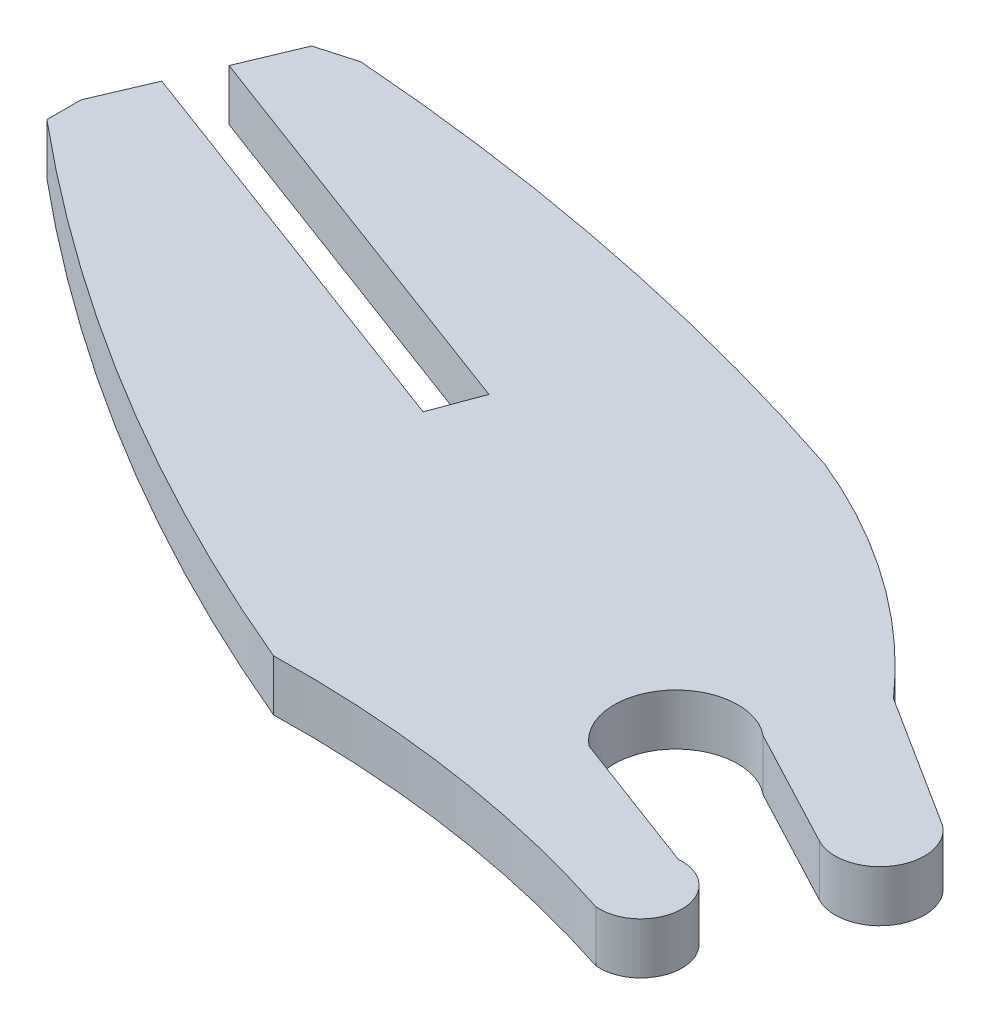
ISO-10303-21;
HEADER;
FILE_DESCRIPTION(('STEP AP214'),'2;1');
FILE_NAME('part.step','',(''),(''),'','','');
FILE_SCHEMA(('AUTOMOTIVE_DESIGN { 1 0 10303 214 1 1 1 1 }'));
ENDSEC;
DATA;
#1=APPLICATION_CONTEXT('core data for automotive mechanical design processes');
#2=APPLICATION_PROTOCOL_DEFINITION('international standard','automotive_design',2000,#1);
#3=PRODUCT_CONTEXT('',#1,'mechanical');
#4=PRODUCT('Part','Part','',(#3));
#5=PRODUCT_RELATED_PRODUCT_CATEGORY('part','',(#4));
#6=PRODUCT_DEFINITION_FORMATION('','',#4);
#7=PRODUCT_DEFINITION_CONTEXT('part definition',#1,'design');
#8=PRODUCT_DEFINITION('design','',#6,#7);
#9=PRODUCT_DEFINITION_SHAPE('','',#8);
#10=(LENGTH_UNIT() NAMED_UNIT(*) SI_UNIT(.MILLI.,.METRE.));
#11=(NAMED_UNIT(*) PLANE_ANGLE_UNIT() SI_UNIT($,.RADIAN.));
#12=(NAMED_UNIT(*) SI_UNIT($,.STERADIAN.) SOLID_ANGLE_UNIT());
#13=UNCERTAINTY_MEASURE_WITH_UNIT(LENGTH_MEASURE(1.E-05),#10,'distance_accuracy_value','');
#14=(GEOMETRIC_REPRESENTATION_CONTEXT(3) GLOBAL_UNCERTAINTY_ASSIGNED_CONTEXT((#13)) GLOBAL_UNIT_ASSIGNED_CONTEXT((#10,
#11,#12)) REPRESENTATION_CONTEXT('',''));
#15=CARTESIAN_POINT('',(0.,0.,0.));
#16=DIRECTION('',(0.,0.,1.));
#17=DIRECTION('',(1.,0.,0.));
#18=AXIS2_PLACEMENT_3D('',#15,#16,#17);
#19=CARTESIAN_POINT('',(-181.665374204054,2.,-473.760145882055));
#20=DIRECTION('',(0.,-1.,0.));
#21=DIRECTION('',(0.,0.,-1.));
#22=AXIS2_PLACEMENT_3D('',#19,#20,#21);
#23=CYLINDRICAL_SURFACE('',#22,24.9948568131);
#24=CARTESIAN_POINT('',(-181.665374204054,0.,-473.760145882055));
#25=DIRECTION('',(0.,1.,0.));
#26=DIRECTION('',(0.,0.,1.));
#27=AXIS2_PLACEMENT_3D('',#24,#25,#26);
#28=CIRCLE('',#27,24.9948568131);
#29=CARTESIAN_POINT('',(-162.931799999989,0.,-490.306930000069));
#30=VERTEX_POINT('',#29);
#31=CARTESIAN_POINT('',(-172.204679999949,0.,-496.895360000013));
#32=VERTEX_POINT('',#31);
#33=EDGE_CURVE('E11',#30,#32,#28,.T.);
#34=ORIENTED_EDGE('',*,*,#33,.T.);
#35=DIRECTION('',(0.,-1.,0.));
#36=VECTOR('',#35,1.);
#37=CARTESIAN_POINT('',(-172.204679999949,2.,-496.895360000013));
#38=LINE('',#37,#36);
#39=CARTESIAN_POINT('',(-172.204679999949,2.,-496.895360000013));
#40=VERTEX_POINT('',#39);
#41=EDGE_CURVE('E343',#40,#32,#38,.T.);
#42=ORIENTED_EDGE('',*,*,#41,.F.);
#43=CARTESIAN_POINT('',(-181.665374204054,2.,-473.760145882055));
#44=DIRECTION('',(0.,1.,0.));
#45=DIRECTION('',(0.,0.,1.));
#46=AXIS2_PLACEMENT_3D('',#43,#44,#45);
#47=CIRCLE('',#46,24.9948568131);
#48=CARTESIAN_POINT('',(-162.931799999989,2.,-490.306930000069));
#49=VERTEX_POINT('',#48);
#50=EDGE_CURVE('E41',#49,#40,#47,.T.);
#51=ORIENTED_EDGE('',*,*,#50,.F.);
#52=DIRECTION('',(0.,-1.,0.));
#53=VECTOR('',#52,1.);
#54=CARTESIAN_POINT('',(-162.931799999989,2.,-490.306930000069));
#55=LINE('',#54,#53);
#56=EDGE_CURVE('E195',#49,#30,#55,.T.);
#57=ORIENTED_EDGE('',*,*,#56,.T.);
#58=EDGE_LOOP('',(#34,#42,#51,#57));
#59=FACE_BOUND('',#58,.T.);
#60=ADVANCED_FACE('F37',(#59),#23,.T.);
#61=CARTESIAN_POINT('',(-201.880906041195,2.,-407.843339205055));
#62=DIRECTION('',(0.,-1.,0.));
#63=DIRECTION('',(0.,0.,-1.));
#64=AXIS2_PLACEMENT_3D('',#61,#62,#63);
#65=CYLINDRICAL_SURFACE('',#64,93.8666117409);
#66=CARTESIAN_POINT('',(-201.880906041195,0.,-407.843339205055));
#67=DIRECTION('',(0.,1.,0.));
#68=DIRECTION('',(0.,0.,1.));
#69=AXIS2_PLACEMENT_3D('',#66,#67,#68);
#70=CIRCLE('',#69,93.8666117409);
#71=CARTESIAN_POINT('',(-194.876650000056,0.,-501.448259999995));
#72=VERTEX_POINT('',#71);
#73=EDGE_CURVE('E47',#32,#72,#70,.T.);
#74=ORIENTED_EDGE('',*,*,#73,.T.);
#75=DIRECTION('',(0.,-1.,0.));
#76=VECTOR('',#75,1.);
#77=CARTESIAN_POINT('',(-194.876650000056,2.,-501.448259999995));
#78=LINE('',#77,#76);
#79=CARTESIAN_POINT('',(-194.876650000056,2.,-501.448259999995));
#80=VERTEX_POINT('',#79);
#81=EDGE_CURVE('E171',#80,#72,#78,.T.);
#82=ORIENTED_EDGE('',*,*,#81,.F.);
#83=CARTESIAN_POINT('',(-201.880906041195,2.,-407.843339205055));
#84=DIRECTION('',(0.,1.,0.));
#85=DIRECTION('',(0.,0.,1.));
#86=AXIS2_PLACEMENT_3D('',#83,#84,#85);
#87=CIRCLE('',#86,93.8666117409);
#88=EDGE_CURVE('E110',#40,#80,#87,.T.);
#89=ORIENTED_EDGE('',*,*,#88,.F.);
#90=ORIENTED_EDGE('',*,*,#41,.T.);
#91=EDGE_LOOP('',(#74,#82,#89,#90));
#92=FACE_BOUND('',#91,.T.);
#93=ADVANCED_FACE('F344',(#92),#65,.T.);
#94=CARTESIAN_POINT('',(-482.243113178539,2.,-419.381304528257));
#95=DIRECTION('',(0.274604349057139,0.,0.961557305353615));
#96=DIRECTION('',(0.961557305353615,0.,-0.274604349057139));
#97=AXIS2_PLACEMENT_3D('',#94,#95,#96);
#98=PLANE('',#97);
#99=DIRECTION('',(-0.961557305353615,0.,0.274604349057139));
#100=VECTOR('',#99,1.);
#101=CARTESIAN_POINT('',(-482.243113178539,0.,-419.381304528257));
#102=LINE('',#101,#100);
#103=CARTESIAN_POINT('',(-196.377439999989,0.,-501.019660000069));
#104=VERTEX_POINT('',#103);
#105=EDGE_CURVE('E165',#72,#104,#102,.T.);
#106=ORIENTED_EDGE('',*,*,#105,.T.);
#107=DIRECTION('',(0.,-1.,0.));
#108=VECTOR('',#107,1.);
#109=CARTESIAN_POINT('',(-196.377439999989,2.,-501.019660000069));
#110=LINE('',#109,#108);
#111=CARTESIAN_POINT('',(-196.377439999989,2.,-501.019660000069));
#112=VERTEX_POINT('',#111);
#113=EDGE_CURVE('E169',#112,#104,#110,.T.);
#114=ORIENTED_EDGE('',*,*,#113,.F.);
#115=DIRECTION('',(-0.961557305353615,0.,0.274604349057139));
#116=VECTOR('',#115,1.);
#117=CARTESIAN_POINT('',(-482.243113178539,2.,-419.381304528257));
#118=LINE('',#117,#116);
#119=EDGE_CURVE('E222',#80,#112,#118,.T.);
#120=ORIENTED_EDGE('',*,*,#119,.F.);
#121=ORIENTED_EDGE('',*,*,#81,.T.);
#122=EDGE_LOOP('',(#106,#114,#120,#121));
#123=FACE_BOUND('',#122,.T.);
#124=ADVANCED_FACE('F167',(#123),#98,.F.);
#125=CARTESIAN_POINT('',(-220.079780414751,2.,-444.318236236712));
#126=DIRECTION('',(0.922632944196995,0.,0.385679206442847));
#127=DIRECTION('',(0.385679206442847,0.,-0.922632944196995));
#128=AXIS2_PLACEMENT_3D('',#125,#126,#127);
#129=PLANE('',#128);
#130=DIRECTION('',(-0.385679206442847,0.,0.922632944196995));
#131=VECTOR('',#130,1.);
#132=CARTESIAN_POINT('',(-220.079780414751,0.,-444.318236236712));
#133=LINE('',#132,#131);
#134=CARTESIAN_POINT('',(-197.327369999989,0.,-498.747210000069));
#135=VERTEX_POINT('',#134);
#136=EDGE_CURVE('E173',#104,#135,#133,.T.);
#137=ORIENTED_EDGE('',*,*,#136,.T.);
#138=DIRECTION('',(0.,-1.,0.));
#139=VECTOR('',#138,1.);
#140=CARTESIAN_POINT('',(-197.327369999989,2.,-498.747210000069));
#141=LINE('',#140,#139);
#142=CARTESIAN_POINT('',(-197.327369999989,2.,-498.747210000069));
#143=VERTEX_POINT('',#142);
#144=EDGE_CURVE('E180',#143,#135,#141,.T.);
#145=ORIENTED_EDGE('',*,*,#144,.F.);
#146=DIRECTION('',(-0.385679206442847,0.,0.922632944196995));
#147=VECTOR('',#146,1.);
#148=CARTESIAN_POINT('',(-220.079780414751,2.,-444.318236236712));
#149=LINE('',#148,#147);
#150=EDGE_CURVE('E179',#112,#143,#149,.T.);
#151=ORIENTED_EDGE('',*,*,#150,.F.);
#152=ORIENTED_EDGE('',*,*,#113,.T.);
#153=EDGE_LOOP('',(#137,#145,#151,#152));
#154=FACE_BOUND('',#153,.T.);
#155=ADVANCED_FACE('F176',(#154),#129,.F.);
#156=CARTESIAN_POINT('',(-509.719619442517,2.,-615.395607149388));
#157=DIRECTION('',(0.349811956896214,0.,-0.936819937241112));
#158=DIRECTION('',(-0.936819937241112,0.,-0.349811956896214));
#159=AXIS2_PLACEMENT_3D('',#156,#157,#158);
#160=PLANE('',#159);
#161=DIRECTION('',(0.936819937241112,0.,0.349811956896214));
#162=VECTOR('',#161,1.);
#163=CARTESIAN_POINT('',(-509.719619442517,0.,-615.395607149388));
#164=LINE('',#163,#162);
#165=CARTESIAN_POINT('',(-181.123509999976,0.,-492.696630000064));
#166=VERTEX_POINT('',#165);
#167=EDGE_CURVE('E185',#135,#166,#164,.T.);
#168=ORIENTED_EDGE('',*,*,#167,.T.);
#169=DIRECTION('',(0.,-1.,0.));
#170=VECTOR('',#169,1.);
#171=CARTESIAN_POINT('',(-181.123509999976,2.,-492.696630000064));
#172=LINE('',#171,#170);
#173=CARTESIAN_POINT('',(-181.123509999976,2.,-492.696630000064));
#174=VERTEX_POINT('',#173);
#175=EDGE_CURVE('E261',#174,#166,#172,.T.);
#176=ORIENTED_EDGE('',*,*,#175,.F.);
#177=DIRECTION('',(0.936819937241112,0.,0.349811956896214));
#178=VECTOR('',#177,1.);
#179=CARTESIAN_POINT('',(-509.719619442517,2.,-615.395607149388));
#180=LINE('',#179,#178);
#181=EDGE_CURVE('E219',#143,#174,#180,.T.);
#182=ORIENTED_EDGE('',*,*,#181,.F.);
#183=ORIENTED_EDGE('',*,*,#144,.T.);
#184=EDGE_LOOP('',(#168,#176,#182,#183));
#185=FACE_BOUND('',#184,.T.);
#186=ADVANCED_FACE('F338',(#185),#160,.F.);
#187=CARTESIAN_POINT('',(-197.2732848146,2.,-449.446202505606));
#188=DIRECTION('',(0.936820586215669,0.,0.349810218893804));
#189=DIRECTION('',(0.349810218893804,0.,-0.936820586215669));
#190=AXIS2_PLACEMENT_3D('',#187,#188,#189);
#191=PLANE('',#190);
#192=DIRECTION('',(-0.349810218893804,0.,0.936820586215669));
#193=VECTOR('',#192,1.);
#194=CARTESIAN_POINT('',(-197.2732848146,0.,-449.446202505606));
#195=LINE('',#194,#193);
#196=CARTESIAN_POINT('',(-181.82313,0.,-490.82299));
#197=VERTEX_POINT('',#196);
#198=EDGE_CURVE('E187',#166,#197,#195,.T.);
#199=ORIENTED_EDGE('',*,*,#198,.T.);
#200=DIRECTION('',(0.,-1.,0.));
#201=VECTOR('',#200,1.);
#202=CARTESIAN_POINT('',(-181.82313,2.,-490.82299));
#203=LINE('',#202,#201);
#204=CARTESIAN_POINT('',(-181.82313,2.,-490.82299));
#205=VERTEX_POINT('',#204);
#206=EDGE_CURVE('E258',#205,#197,#203,.T.);
#207=ORIENTED_EDGE('',*,*,#206,.F.);
#208=DIRECTION('',(-0.349810218893804,0.,0.936820586215669));
#209=VECTOR('',#208,1.);
#210=CARTESIAN_POINT('',(-197.2732848146,2.,-449.446202505606));
#211=LINE('',#210,#209);
#212=EDGE_CURVE('E217',#174,#205,#211,.T.);
#213=ORIENTED_EDGE('',*,*,#212,.F.);
#214=ORIENTED_EDGE('',*,*,#175,.T.);
#215=EDGE_LOOP('',(#199,#207,#213,#214));
#216=FACE_BOUND('',#215,.T.);
#217=ADVANCED_FACE('F256',(#216),#191,.F.);
#218=CARTESIAN_POINT('',(-510.419222862414,2.,-613.522006725113));
#219=DIRECTION('',(-0.349812071409836,0.,0.936819894481303));
#220=DIRECTION('',(0.936819894481303,0.,0.349812071409836));
#221=AXIS2_PLACEMENT_3D('',#218,#219,#220);
#222=PLANE('',#221);
#223=DIRECTION('',(-0.936819894481303,0.,-0.349812071409836));
#224=VECTOR('',#223,1.);
#225=CARTESIAN_POINT('',(-510.419222862414,0.,-613.522006725113));
#226=LINE('',#225,#224);
#227=CARTESIAN_POINT('',(-198.11611,0.,-496.90685));
#228=VERTEX_POINT('',#227);
#229=EDGE_CURVE('E251',#197,#228,#226,.T.);
#230=ORIENTED_EDGE('',*,*,#229,.T.);
#231=DIRECTION('',(0.,-1.,0.));
#232=VECTOR('',#231,1.);
#233=CARTESIAN_POINT('',(-198.11611,2.,-496.90685));
#234=LINE('',#233,#232);
#235=CARTESIAN_POINT('',(-198.11611,2.,-496.90685));
#236=VERTEX_POINT('',#235);
#237=EDGE_CURVE('E267',#236,#228,#234,.T.);
#238=ORIENTED_EDGE('',*,*,#237,.F.);
#239=DIRECTION('',(-0.936819894481303,0.,-0.349812071409836));
#240=VECTOR('',#239,1.);
#241=CARTESIAN_POINT('',(-510.419222862414,2.,-613.522006725113));
#242=LINE('',#241,#240);
#243=EDGE_CURVE('E215',#205,#236,#242,.T.);
#244=ORIENTED_EDGE('',*,*,#243,.F.);
#245=ORIENTED_EDGE('',*,*,#206,.T.);
#246=EDGE_LOOP('',(#230,#238,#244,#245));
#247=FACE_BOUND('',#246,.T.);
#248=ADVANCED_FACE('F264',(#247),#222,.F.);
#249=CARTESIAN_POINT('',(-221.369592411402,2.,-442.352693684703));
#250=DIRECTION('',(0.919917844036022,0.,0.39211115799492));
#251=DIRECTION('',(0.39211115799492,0.,-0.919917844036022));
#252=AXIS2_PLACEMENT_3D('',#249,#250,#251);
#253=PLANE('',#252);
#254=DIRECTION('',(-0.39211115799492,0.,0.919917844036022));
#255=VECTOR('',#254,1.);
#256=CARTESIAN_POINT('',(-221.369592411402,0.,-442.352693684703));
#257=LINE('',#256,#255);
#258=CARTESIAN_POINT('',(-199.05715,0.,-494.69911));
#259=VERTEX_POINT('',#258);
#260=EDGE_CURVE('E249',#228,#259,#257,.T.);
#261=ORIENTED_EDGE('',*,*,#260,.T.);
#262=DIRECTION('',(0.,-1.,0.));
#263=VECTOR('',#262,1.);
#264=CARTESIAN_POINT('',(-199.05715,2.,-494.69911));
#265=LINE('',#264,#263);
#266=CARTESIAN_POINT('',(-199.05715,2.,-494.69911));
#267=VERTEX_POINT('',#266);
#268=EDGE_CURVE('E277',#267,#259,#265,.T.);
#269=ORIENTED_EDGE('',*,*,#268,.F.);
#270=DIRECTION('',(-0.39211115799492,0.,0.919917844036022));
#271=VECTOR('',#270,1.);
#272=CARTESIAN_POINT('',(-221.369592411402,2.,-442.352693684703));
#273=LINE('',#272,#271);
#274=EDGE_CURVE('E213',#236,#267,#273,.T.);
#275=ORIENTED_EDGE('',*,*,#274,.F.);
#276=ORIENTED_EDGE('',*,*,#237,.T.);
#277=EDGE_LOOP('',(#261,#269,#275,#276));
#278=FACE_BOUND('',#277,.T.);
#279=ADVANCED_FACE('F275',(#278),#253,.F.);
#280=CARTESIAN_POINT('',(-199.05715,2.,-572.1446));
#281=DIRECTION('',(1.,0.,0.));
#282=DIRECTION('',(0.,0.,-1.));
#283=AXIS2_PLACEMENT_3D('',#280,#281,#282);
#284=PLANE('',#283);
#285=DIRECTION('',(0.,0.,1.));
#286=VECTOR('',#285,1.);
#287=CARTESIAN_POINT('',(-199.05715,0.,-572.1446));
#288=LINE('',#287,#286);
#289=CARTESIAN_POINT('',(-199.05715,0.,-493.36006));
#290=VERTEX_POINT('',#289);
#291=EDGE_CURVE('E247',#259,#290,#288,.T.);
#292=ORIENTED_EDGE('',*,*,#291,.T.);
#293=DIRECTION('',(0.,-1.,0.));
#294=VECTOR('',#293,1.);
#295=CARTESIAN_POINT('',(-199.05715,2.,-493.36006));
#296=LINE('',#295,#294);
#297=CARTESIAN_POINT('',(-199.05715,2.,-493.36006));
#298=VERTEX_POINT('',#297);
#299=EDGE_CURVE('E283',#298,#290,#296,.T.);
#300=ORIENTED_EDGE('',*,*,#299,.F.);
#301=DIRECTION('',(0.,0.,1.));
#302=VECTOR('',#301,1.);
#303=CARTESIAN_POINT('',(-199.05715,2.,-572.1446));
#304=LINE('',#303,#302);
#305=EDGE_CURVE('E211',#267,#298,#304,.T.);
#306=ORIENTED_EDGE('',*,*,#305,.F.);
#307=ORIENTED_EDGE('',*,*,#268,.T.);
#308=EDGE_LOOP('',(#292,#300,#306,#307));
#309=FACE_BOUND('',#308,.T.);
#310=ADVANCED_FACE('F280',(#309),#284,.F.);
#311=CARTESIAN_POINT('',(-141.953553513997,2.,-561.908172135341));
#312=DIRECTION('',(0.,-1.,0.));
#313=DIRECTION('',(0.,0.,-1.));
#314=AXIS2_PLACEMENT_3D('',#311,#312,#313);
#315=CYLINDRICAL_SURFACE('',#314,89.2169513543001);
#316=CARTESIAN_POINT('',(-141.953553513997,0.,-561.908172135341));
#317=DIRECTION('',(0.,1.,0.));
#318=DIRECTION('',(0.,0.,1.));
#319=AXIS2_PLACEMENT_3D('',#316,#317,#318);
#320=CIRCLE('',#319,89.2169513543001);
#321=CARTESIAN_POINT('',(-176.492660000002,0.,-479.648130000025));
#322=VERTEX_POINT('',#321);
#323=EDGE_CURVE('E244',#290,#322,#320,.T.);
#324=ORIENTED_EDGE('',*,*,#323,.T.);
#325=DIRECTION('',(0.,-1.,0.));
#326=VECTOR('',#325,1.);
#327=CARTESIAN_POINT('',(-176.492660000002,2.,-479.648130000025));
#328=LINE('',#327,#326);
#329=CARTESIAN_POINT('',(-176.492660000002,2.,-479.648130000025));
#330=VERTEX_POINT('',#329);
#331=EDGE_CURVE('E285',#330,#322,#328,.T.);
#332=ORIENTED_EDGE('',*,*,#331,.F.);
#333=CARTESIAN_POINT('',(-141.953553513997,2.,-561.908172135341));
#334=DIRECTION('',(0.,1.,0.));
#335=DIRECTION('',(0.,0.,1.));
#336=AXIS2_PLACEMENT_3D('',#333,#334,#335);
#337=CIRCLE('',#336,89.2169513543001);
#338=EDGE_CURVE('E209',#298,#330,#337,.T.);
#339=ORIENTED_EDGE('',*,*,#338,.F.);
#340=ORIENTED_EDGE('',*,*,#299,.T.);
#341=EDGE_LOOP('',(#324,#332,#339,#340));
#342=FACE_BOUND('',#341,.T.);
#343=ADVANCED_FACE('F334',(#342),#315,.T.);
#344=CARTESIAN_POINT('',(-175.536136222701,2.,-435.170060923836));
#345=DIRECTION('',(0.,-1.,0.));
#346=DIRECTION('',(0.,0.,-1.));
#347=AXIS2_PLACEMENT_3D('',#344,#345,#346);
#348=CYLINDRICAL_SURFACE('',#347,44.4883531554358);
#349=CARTESIAN_POINT('',(-175.536136222701,0.,-435.170060923836));
#350=DIRECTION('',(0.,1.,0.));
#351=DIRECTION('',(0.,0.,1.));
#352=AXIS2_PLACEMENT_3D('',#349,#350,#351);
#353=CIRCLE('',#352,44.4883531554358);
#354=CARTESIAN_POINT('',(-161.699150000021,0.,-477.451870000035));
#355=VERTEX_POINT('',#354);
#356=EDGE_CURVE('E241',#355,#322,#353,.T.);
#357=ORIENTED_EDGE('',*,*,#356,.F.);
#358=DIRECTION('',(0.,-1.,0.));
#359=VECTOR('',#358,1.);
#360=CARTESIAN_POINT('',(-161.699150000021,2.,-477.451870000035));
#361=LINE('',#360,#359);
#362=CARTESIAN_POINT('',(-161.699150000021,2.,-477.451870000035));
#363=VERTEX_POINT('',#362);
#364=EDGE_CURVE('E290',#363,#355,#361,.T.);
#365=ORIENTED_EDGE('',*,*,#364,.F.);
#366=CARTESIAN_POINT('',(-175.536136222701,2.,-435.170060923836));
#367=DIRECTION('',(0.,1.,0.));
#368=DIRECTION('',(0.,0.,1.));
#369=AXIS2_PLACEMENT_3D('',#366,#367,#368);
#370=CIRCLE('',#369,44.4883531554358);
#371=EDGE_CURVE('E206',#363,#330,#370,.T.);
#372=ORIENTED_EDGE('',*,*,#371,.T.);
#373=ORIENTED_EDGE('',*,*,#331,.T.);
#374=EDGE_LOOP('',(#357,#365,#372,#373));
#375=FACE_BOUND('',#374,.T.);
#376=ADVANCED_FACE('F331',(#375),#348,.F.);
#377=CARTESIAN_POINT('',(-161.557540000307,2.,-479.058795000042));
#378=DIRECTION('',(0.,-1.,0.));
#379=DIRECTION('',(0.,0.,-1.));
#380=AXIS2_PLACEMENT_3D('',#377,#378,#379);
#381=CYLINDRICAL_SURFACE('',#380,1.61315261140004);
#382=CARTESIAN_POINT('',(-161.557540000307,0.,-479.058795000042));
#383=DIRECTION('',(0.,1.,0.));
#384=DIRECTION('',(0.,0.,1.));
#385=AXIS2_PLACEMENT_3D('',#382,#383,#384);
#386=CIRCLE('',#385,1.61315261140004);
#387=CARTESIAN_POINT('',(-161.699149999989,0.,-480.665720000052));
#388=VERTEX_POINT('',#387);
#389=EDGE_CURVE('E239',#355,#388,#386,.T.);
#390=ORIENTED_EDGE('',*,*,#389,.T.);
#391=DIRECTION('',(0.,-1.,0.));
#392=VECTOR('',#391,1.);
#393=CARTESIAN_POINT('',(-161.699149999989,2.,-480.665720000052));
#394=LINE('',#393,#392);
#395=CARTESIAN_POINT('',(-161.699149999989,2.,-480.665720000052));
#396=VERTEX_POINT('',#395);
#397=EDGE_CURVE('E292',#396,#388,#394,.T.);
#398=ORIENTED_EDGE('',*,*,#397,.F.);
#399=CARTESIAN_POINT('',(-161.557540000307,2.,-479.058795000042));
#400=DIRECTION('',(0.,1.,0.));
#401=DIRECTION('',(0.,0.,1.));
#402=AXIS2_PLACEMENT_3D('',#399,#400,#401);
#403=CIRCLE('',#402,1.61315261140004);
#404=EDGE_CURVE('E204',#363,#396,#403,.T.);
#405=ORIENTED_EDGE('',*,*,#404,.F.);
#406=ORIENTED_EDGE('',*,*,#364,.T.);
#407=EDGE_LOOP('',(#390,#398,#405,#406));
#408=FACE_BOUND('',#407,.T.);
#409=ADVANCED_FACE('F328',(#408),#381,.T.);
#410=CARTESIAN_POINT('',(-511.081396419342,2.,-611.604149671496));
#411=DIRECTION('',(-0.350935661379806,0.,0.936399573671367));
#412=DIRECTION('',(0.936399573671367,0.,0.350935661379806));
#413=AXIS2_PLACEMENT_3D('',#410,#411,#412);
#414=PLANE('',#413);
#415=DIRECTION('',(-0.936399573671367,0.,-0.350935661379806));
#416=VECTOR('',#415,1.);
#417=CARTESIAN_POINT('',(-511.081396419342,0.,-611.604149671496));
#418=LINE('',#417,#416);
#419=CARTESIAN_POINT('',(-167.27350999999,0.,-482.75483000007));
#420=VERTEX_POINT('',#419);
#421=EDGE_CURVE('E236',#388,#420,#418,.T.);
#422=ORIENTED_EDGE('',*,*,#421,.T.);
#423=DIRECTION('',(0.,-1.,0.));
#424=VECTOR('',#423,1.);
#425=CARTESIAN_POINT('',(-167.27350999999,2.,-482.75483000007));
#426=LINE('',#425,#424);
#427=CARTESIAN_POINT('',(-167.27350999999,2.,-482.75483000007));
#428=VERTEX_POINT('',#427);
#429=EDGE_CURVE('E295',#428,#420,#426,.T.);
#430=ORIENTED_EDGE('',*,*,#429,.F.);
#431=DIRECTION('',(-0.936399573671367,0.,-0.350935661379806));
#432=VECTOR('',#431,1.);
#433=CARTESIAN_POINT('',(-511.081396419342,2.,-611.604149671496));
#434=LINE('',#433,#432);
#435=EDGE_CURVE('E202',#396,#428,#434,.T.);
#436=ORIENTED_EDGE('',*,*,#435,.F.);
#437=ORIENTED_EDGE('',*,*,#397,.T.);
#438=EDGE_LOOP('',(#422,#430,#436,#437));
#439=FACE_BOUND('',#438,.T.);
#440=ADVANCED_FACE('F323',(#439),#414,.F.);
#441=CARTESIAN_POINT('',(-165.76308155372,2.,-484.643498093432));
#442=DIRECTION('',(0.,-1.,0.));
#443=DIRECTION('',(0.,0.,-1.));
#444=AXIS2_PLACEMENT_3D('',#441,#442,#443);
#445=CYLINDRICAL_SURFACE('',#444,2.4183592078484);
#446=CARTESIAN_POINT('',(-165.76308155372,0.,-484.643498093432));
#447=DIRECTION('',(0.,1.,0.));
#448=DIRECTION('',(0.,0.,1.));
#449=AXIS2_PLACEMENT_3D('',#446,#447,#448);
#450=CIRCLE('',#449,2.4183592078484);
#451=CARTESIAN_POINT('',(-164.218199999973,0.,-486.504090000079));
#452=VERTEX_POINT('',#451);
#453=EDGE_CURVE('E233',#452,#420,#450,.T.);
#454=ORIENTED_EDGE('',*,*,#453,.F.);
#455=DIRECTION('',(0.,-1.,0.));
#456=VECTOR('',#455,1.);
#457=CARTESIAN_POINT('',(-164.218199999973,2.,-486.504090000079));
#458=LINE('',#457,#456);
#459=CARTESIAN_POINT('',(-164.218199999973,2.,-486.504090000079));
#460=VERTEX_POINT('',#459);
#461=EDGE_CURVE('E297',#460,#452,#458,.T.);
#462=ORIENTED_EDGE('',*,*,#461,.F.);
#463=CARTESIAN_POINT('',(-165.76308155372,2.,-484.643498093432));
#464=DIRECTION('',(0.,1.,0.));
#465=DIRECTION('',(0.,0.,1.));
#466=AXIS2_PLACEMENT_3D('',#463,#464,#465);
#467=CIRCLE('',#466,2.4183592078484);
#468=EDGE_CURVE('E199',#460,#428,#467,.T.);
#469=ORIENTED_EDGE('',*,*,#468,.T.);
#470=ORIENTED_EDGE('',*,*,#429,.T.);
#471=EDGE_LOOP('',(#454,#462,#469,#470));
#472=FACE_BOUND('',#471,.T.);
#473=ADVANCED_FACE('F317',(#472),#445,.F.);
#474=CARTESIAN_POINT('',(-482.315819354337,2.,-654.575934460919));
#475=DIRECTION('',(0.467165084545633,0.,-0.884170110205876));
#476=DIRECTION('',(-0.884170110205876,0.,-0.467165084545633));
#477=AXIS2_PLACEMENT_3D('',#474,#475,#476);
#478=PLANE('',#477);
#479=DIRECTION('',(0.884170110205876,0.,0.467165084545633));
#480=VECTOR('',#479,1.);
#481=CARTESIAN_POINT('',(-482.315819354337,0.,-654.575934460919));
#482=LINE('',#481,#480);
#483=CARTESIAN_POINT('',(-159.555159999989,0.,-484.040300000069));
#484=VERTEX_POINT('',#483);
#485=EDGE_CURVE('E227',#452,#484,#482,.T.);
#486=ORIENTED_EDGE('',*,*,#485,.T.);
#487=DIRECTION('',(0.,-1.,0.));
#488=VECTOR('',#487,1.);
#489=CARTESIAN_POINT('',(-159.555159999989,2.,-484.040300000069));
#490=LINE('',#489,#488);
#491=CARTESIAN_POINT('',(-159.555159999989,2.,-484.040300000069));
#492=VERTEX_POINT('',#491);
#493=EDGE_CURVE('E299',#492,#484,#490,.T.);
#494=ORIENTED_EDGE('',*,*,#493,.F.);
#495=DIRECTION('',(0.884170110205876,0.,0.467165084545633));
#496=VECTOR('',#495,1.);
#497=CARTESIAN_POINT('',(-482.315819354337,2.,-654.575934460919));
#498=LINE('',#497,#496);
#499=EDGE_CURVE('E197',#460,#492,#498,.T.);
#500=ORIENTED_EDGE('',*,*,#499,.F.);
#501=ORIENTED_EDGE('',*,*,#461,.T.);
#502=EDGE_LOOP('',(#486,#494,#500,#501));
#503=FACE_BOUND('',#502,.T.);
#504=ADVANCED_FACE('F314',(#503),#478,.F.);
#505=CARTESIAN_POINT('',(-158.747938966229,2.,-485.5904416135));
#506=DIRECTION('',(0.,-1.,0.));
#507=DIRECTION('',(0.,0.,-1.));
#508=AXIS2_PLACEMENT_3D('',#505,#506,#507);
#509=CYLINDRICAL_SURFACE('',#508,1.74772561319996);
#510=CARTESIAN_POINT('',(-158.747938966229,0.,-485.5904416135));
#511=DIRECTION('',(0.,1.,0.));
#512=DIRECTION('',(0.,0.,1.));
#513=AXIS2_PLACEMENT_3D('',#510,#511,#512);
#514=CIRCLE('',#513,1.74772561319996);
#515=CARTESIAN_POINT('',(-157.676880000013,0.,-486.971520000097));
#516=VERTEX_POINT('',#515);
#517=EDGE_CURVE('E225',#484,#516,#514,.T.);
#518=ORIENTED_EDGE('',*,*,#517,.T.);
#519=DIRECTION('',(0.,-1.,0.));
#520=VECTOR('',#519,1.);
#521=CARTESIAN_POINT('',(-157.676880000013,2.,-486.971520000097));
#522=LINE('',#521,#520);
#523=CARTESIAN_POINT('',(-157.676880000013,2.,-486.971520000097));
#524=VERTEX_POINT('',#523);
#525=EDGE_CURVE('E301',#524,#516,#522,.T.);
#526=ORIENTED_EDGE('',*,*,#525,.F.);
#527=CARTESIAN_POINT('',(-158.747938966229,2.,-485.5904416135));
#528=DIRECTION('',(0.,1.,0.));
#529=DIRECTION('',(0.,0.,1.));
#530=AXIS2_PLACEMENT_3D('',#527,#528,#529);
#531=CIRCLE('',#530,1.74772561319996);
#532=EDGE_CURVE('E194',#492,#524,#531,.T.);
#533=ORIENTED_EDGE('',*,*,#532,.F.);
#534=ORIENTED_EDGE('',*,*,#493,.T.);
#535=EDGE_LOOP('',(#518,#526,#533,#534));
#536=FACE_BOUND('',#535,.T.);
#537=ADVANCED_FACE('F309',(#536),#509,.T.);
#538=CARTESIAN_POINT('',(-458.669581325077,2.,-678.018018504923));
#539=DIRECTION('',(-0.535888226944476,0.,0.844288936456179));
#540=DIRECTION('',(0.844288936456179,0.,0.535888226944476));
#541=AXIS2_PLACEMENT_3D('',#538,#539,#540);
#542=PLANE('',#541);
#543=DIRECTION('',(-0.844288936456179,0.,-0.535888226944476));
#544=VECTOR('',#543,1.);
#545=CARTESIAN_POINT('',(-458.669581325077,0.,-678.018018504923));
#546=LINE('',#545,#544);
#547=EDGE_CURVE('E121',#516,#30,#546,.T.);
#548=ORIENTED_EDGE('',*,*,#547,.T.);
#549=ORIENTED_EDGE('',*,*,#56,.F.);
#550=DIRECTION('',(-0.844288936456179,0.,-0.535888226944476));
#551=VECTOR('',#550,1.);
#552=CARTESIAN_POINT('',(-458.669581325077,2.,-678.018018504923));
#553=LINE('',#552,#551);
#554=EDGE_CURVE('E192',#524,#49,#553,.T.);
#555=ORIENTED_EDGE('',*,*,#554,.F.);
#556=ORIENTED_EDGE('',*,*,#525,.T.);
#557=EDGE_LOOP('',(#548,#549,#555,#556));
#558=FACE_BOUND('',#557,.T.);
#559=ADVANCED_FACE('F380',(#558),#542,.F.);
#560=CARTESIAN_POINT('',(-525.869702128861,2.,-572.1446));
#561=DIRECTION('',(0.,1.,0.));
#562=DIRECTION('',(0.,0.,1.));
#563=AXIS2_PLACEMENT_3D('',#560,#561,#562);
#564=PLANE('',#563);
#565=ORIENTED_EDGE('',*,*,#50,.T.);
#566=ORIENTED_EDGE('',*,*,#88,.T.);
#567=ORIENTED_EDGE('',*,*,#119,.T.);
#568=ORIENTED_EDGE('',*,*,#150,.T.);
#569=ORIENTED_EDGE('',*,*,#181,.T.);
#570=ORIENTED_EDGE('',*,*,#212,.T.);
#571=ORIENTED_EDGE('',*,*,#243,.T.);
#572=ORIENTED_EDGE('',*,*,#274,.T.);
#573=ORIENTED_EDGE('',*,*,#305,.T.);
#574=ORIENTED_EDGE('',*,*,#338,.T.);
#575=ORIENTED_EDGE('',*,*,#371,.F.);
#576=ORIENTED_EDGE('',*,*,#404,.T.);
#577=ORIENTED_EDGE('',*,*,#435,.T.);
#578=ORIENTED_EDGE('',*,*,#468,.F.);
#579=ORIENTED_EDGE('',*,*,#499,.T.);
#580=ORIENTED_EDGE('',*,*,#532,.T.);
#581=ORIENTED_EDGE('',*,*,#554,.T.);
#582=EDGE_LOOP('',(#565,#566,#567,#568,#569,#570,#571,#572,#573,#574,#575,#576,#577,#578,#579,
#580,#581));
#583=FACE_BOUND('',#582,.T.);
#584=ADVANCED_FACE('F39',(#583),#564,.T.);
#585=CARTESIAN_POINT('',(-525.869702128861,0.,-572.1446));
#586=DIRECTION('',(0.,1.,0.));
#587=DIRECTION('',(0.,0.,1.));
#588=AXIS2_PLACEMENT_3D('',#585,#586,#587);
#589=PLANE('',#588);
#590=ORIENTED_EDGE('',*,*,#33,.F.);
#591=ORIENTED_EDGE('',*,*,#547,.F.);
#592=ORIENTED_EDGE('',*,*,#517,.F.);
#593=ORIENTED_EDGE('',*,*,#485,.F.);
#594=ORIENTED_EDGE('',*,*,#453,.T.);
#595=ORIENTED_EDGE('',*,*,#421,.F.);
#596=ORIENTED_EDGE('',*,*,#389,.F.);
#597=ORIENTED_EDGE('',*,*,#356,.T.);
#598=ORIENTED_EDGE('',*,*,#323,.F.);
#599=ORIENTED_EDGE('',*,*,#291,.F.);
#600=ORIENTED_EDGE('',*,*,#260,.F.);
#601=ORIENTED_EDGE('',*,*,#229,.F.);
#602=ORIENTED_EDGE('',*,*,#198,.F.);
#603=ORIENTED_EDGE('',*,*,#167,.F.);
#604=ORIENTED_EDGE('',*,*,#136,.F.);
#605=ORIENTED_EDGE('',*,*,#105,.F.);
#606=ORIENTED_EDGE('',*,*,#73,.F.);
#607=EDGE_LOOP('',(#590,#591,#592,#593,#594,#595,#596,#597,#598,#599,#600,#601,#602,#603,#604,
#605,#606));
#608=FACE_BOUND('',#607,.T.);
#609=ADVANCED_FACE('F183',(#608),#589,.F.);
#610=CLOSED_SHELL('',(#60,#93,#124,#155,#186,#217,#248,#279,#310,#343,#376,#409,#440,#473,#504,
#537,#559,#584,#609));
#611=MANIFOLD_SOLID_BREP('B2',#610);
#612=ADVANCED_BREP_SHAPE_REPRESENTATION('',(#18,#611),#14);
#613=SHAPE_DEFINITION_REPRESENTATION(#9,#612);
ENDSEC;
END-ISO-10303-21;
